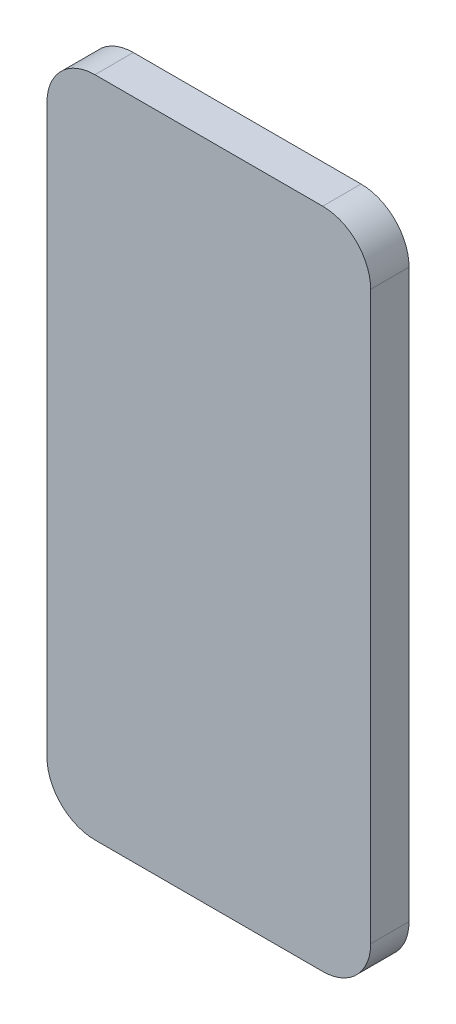
ISO-10303-21;
HEADER;
FILE_DESCRIPTION(('STEP AP214'),'2;1');
FILE_NAME('part.step','',(''),(''),'','','');
FILE_SCHEMA(('AUTOMOTIVE_DESIGN { 1 0 10303 214 1 1 1 1 }'));
ENDSEC;
DATA;
#1=APPLICATION_CONTEXT('core data for automotive mechanical design processes');
#2=APPLICATION_PROTOCOL_DEFINITION('international standard','automotive_design',2000,#1);
#3=PRODUCT_CONTEXT('',#1,'mechanical');
#4=PRODUCT('Part','Part','',(#3));
#5=PRODUCT_RELATED_PRODUCT_CATEGORY('part','',(#4));
#6=PRODUCT_DEFINITION_FORMATION('','',#4);
#7=PRODUCT_DEFINITION_CONTEXT('part definition',#1,'design');
#8=PRODUCT_DEFINITION('design','',#6,#7);
#9=PRODUCT_DEFINITION_SHAPE('','',#8);
#10=(LENGTH_UNIT() NAMED_UNIT(*) SI_UNIT(.MILLI.,.METRE.));
#11=(NAMED_UNIT(*) PLANE_ANGLE_UNIT() SI_UNIT($,.RADIAN.));
#12=(NAMED_UNIT(*) SI_UNIT($,.STERADIAN.) SOLID_ANGLE_UNIT());
#13=UNCERTAINTY_MEASURE_WITH_UNIT(LENGTH_MEASURE(1.E-05),#10,'distance_accuracy_value','');
#14=(GEOMETRIC_REPRESENTATION_CONTEXT(3) GLOBAL_UNCERTAINTY_ASSIGNED_CONTEXT((#13)) GLOBAL_UNIT_ASSIGNED_CONTEXT((#10,
#11,#12)) REPRESENTATION_CONTEXT('',''));
#15=CARTESIAN_POINT('',(0.,0.,0.));
#16=DIRECTION('',(0.,0.,1.));
#17=DIRECTION('',(1.,0.,0.));
#18=AXIS2_PLACEMENT_3D('',#15,#16,#17);
#19=CARTESIAN_POINT('',(22.606,56.261,7.62));
#20=DIRECTION('',(0.,0.,-1.));
#21=DIRECTION('',(-1.,0.,0.));
#22=AXIS2_PLACEMENT_3D('',#19,#20,#21);
#23=CYLINDRICAL_SURFACE('',#22,9.525);
#24=CARTESIAN_POINT('',(22.606,56.261,0.));
#25=DIRECTION('',(0.,0.,1.));
#26=DIRECTION('',(-1.,0.,0.));
#27=AXIS2_PLACEMENT_3D('',#24,#25,#26);
#28=CIRCLE('',#27,9.525);
#29=CARTESIAN_POINT('',(32.131,56.261,0.));
#30=VERTEX_POINT('',#29);
#31=CARTESIAN_POINT('',(22.606,65.786,0.));
#32=VERTEX_POINT('',#31);
#33=EDGE_CURVE('E140',#30,#32,#28,.T.);
#34=ORIENTED_EDGE('',*,*,#33,.T.);
#35=DIRECTION('',(0.,0.,-1.));
#36=VECTOR('',#35,1.);
#37=CARTESIAN_POINT('',(22.606,65.786,7.62));
#38=LINE('',#37,#36);
#39=CARTESIAN_POINT('',(22.606,65.786,7.62));
#40=VERTEX_POINT('',#39);
#41=EDGE_CURVE('E11',#40,#32,#38,.T.);
#42=ORIENTED_EDGE('',*,*,#41,.F.);
#43=CARTESIAN_POINT('',(22.606,56.261,7.62));
#44=DIRECTION('',(0.,0.,1.));
#45=DIRECTION('',(-1.,0.,0.));
#46=AXIS2_PLACEMENT_3D('',#43,#44,#45);
#47=CIRCLE('',#46,9.525);
#48=CARTESIAN_POINT('',(32.131,56.261,7.62));
#49=VERTEX_POINT('',#48);
#50=EDGE_CURVE('E162',#49,#40,#47,.T.);
#51=ORIENTED_EDGE('',*,*,#50,.F.);
#52=DIRECTION('',(0.,0.,-1.));
#53=VECTOR('',#52,1.);
#54=CARTESIAN_POINT('',(32.131,56.261,7.62));
#55=LINE('',#54,#53);
#56=EDGE_CURVE('E136',#49,#30,#55,.T.);
#57=ORIENTED_EDGE('',*,*,#56,.T.);
#58=EDGE_LOOP('',(#34,#42,#51,#57));
#59=FACE_BOUND('',#58,.T.);
#60=ADVANCED_FACE('F39',(#59),#23,.T.);
#61=CARTESIAN_POINT('',(-22.606,65.786,7.62));
#62=DIRECTION('',(0.,-1.,0.));
#63=DIRECTION('',(0.,0.,-1.));
#64=AXIS2_PLACEMENT_3D('',#61,#62,#63);
#65=PLANE('',#64);
#66=DIRECTION('',(-1.,0.,0.));
#67=VECTOR('',#66,1.);
#68=CARTESIAN_POINT('',(-22.606,65.786,0.));
#69=LINE('',#68,#67);
#70=CARTESIAN_POINT('',(-22.606,65.786,0.));
#71=VERTEX_POINT('',#70);
#72=EDGE_CURVE('E144',#32,#71,#69,.T.);
#73=ORIENTED_EDGE('',*,*,#72,.T.);
#74=DIRECTION('',(0.,0.,-1.));
#75=VECTOR('',#74,1.);
#76=CARTESIAN_POINT('',(-22.606,65.786,7.62));
#77=LINE('',#76,#75);
#78=CARTESIAN_POINT('',(-22.606,65.786,7.62));
#79=VERTEX_POINT('',#78);
#80=EDGE_CURVE('E48',#79,#71,#77,.T.);
#81=ORIENTED_EDGE('',*,*,#80,.F.);
#82=DIRECTION('',(-1.,0.,0.));
#83=VECTOR('',#82,1.);
#84=CARTESIAN_POINT('',(-22.606,65.786,7.62));
#85=LINE('',#84,#83);
#86=EDGE_CURVE('E99',#40,#79,#85,.T.);
#87=ORIENTED_EDGE('',*,*,#86,.F.);
#88=ORIENTED_EDGE('',*,*,#41,.T.);
#89=EDGE_LOOP('',(#73,#81,#87,#88));
#90=FACE_BOUND('',#89,.T.);
#91=ADVANCED_FACE('F208',(#90),#65,.F.);
#92=CARTESIAN_POINT('',(-22.606,56.261,7.62));
#93=DIRECTION('',(0.,0.,-1.));
#94=DIRECTION('',(-1.,0.,0.));
#95=AXIS2_PLACEMENT_3D('',#92,#93,#94);
#96=CYLINDRICAL_SURFACE('',#95,9.525);
#97=CARTESIAN_POINT('',(-22.606,56.261,0.));
#98=DIRECTION('',(0.,0.,1.));
#99=DIRECTION('',(-1.,0.,0.));
#100=AXIS2_PLACEMENT_3D('',#97,#98,#99);
#101=CIRCLE('',#100,9.525);
#102=CARTESIAN_POINT('',(-32.131,56.261,0.));
#103=VERTEX_POINT('',#102);
#104=EDGE_CURVE('E147',#71,#103,#101,.T.);
#105=ORIENTED_EDGE('',*,*,#104,.T.);
#106=DIRECTION('',(0.,0.,-1.));
#107=VECTOR('',#106,1.);
#108=CARTESIAN_POINT('',(-32.131,56.261,7.62));
#109=LINE('',#108,#107);
#110=CARTESIAN_POINT('',(-32.131,56.261,7.62));
#111=VERTEX_POINT('',#110);
#112=EDGE_CURVE('E173',#111,#103,#109,.T.);
#113=ORIENTED_EDGE('',*,*,#112,.F.);
#114=CARTESIAN_POINT('',(-22.606,56.261,7.62));
#115=DIRECTION('',(0.,0.,1.));
#116=DIRECTION('',(-1.,0.,0.));
#117=AXIS2_PLACEMENT_3D('',#114,#115,#116);
#118=CIRCLE('',#117,9.525);
#119=EDGE_CURVE('E183',#79,#111,#118,.T.);
#120=ORIENTED_EDGE('',*,*,#119,.F.);
#121=ORIENTED_EDGE('',*,*,#80,.T.);
#122=EDGE_LOOP('',(#105,#113,#120,#121));
#123=FACE_BOUND('',#122,.T.);
#124=ADVANCED_FACE('F181',(#123),#96,.T.);
#125=CARTESIAN_POINT('',(-32.131,-56.261,7.62));
#126=DIRECTION('',(1.,0.,0.));
#127=DIRECTION('',(0.,0.,-1.));
#128=AXIS2_PLACEMENT_3D('',#125,#126,#127);
#129=PLANE('',#128);
#130=DIRECTION('',(0.,-1.,0.));
#131=VECTOR('',#130,1.);
#132=CARTESIAN_POINT('',(-32.131,-56.261,0.));
#133=LINE('',#132,#131);
#134=CARTESIAN_POINT('',(-32.131,-56.261,0.));
#135=VERTEX_POINT('',#134);
#136=EDGE_CURVE('E150',#103,#135,#133,.T.);
#137=ORIENTED_EDGE('',*,*,#136,.T.);
#138=DIRECTION('',(0.,0.,-1.));
#139=VECTOR('',#138,1.);
#140=CARTESIAN_POINT('',(-32.131,-56.261,7.62));
#141=LINE('',#140,#139);
#142=CARTESIAN_POINT('',(-32.131,-56.261,7.62));
#143=VERTEX_POINT('',#142);
#144=EDGE_CURVE('E169',#143,#135,#141,.T.);
#145=ORIENTED_EDGE('',*,*,#144,.F.);
#146=DIRECTION('',(0.,-1.,0.));
#147=VECTOR('',#146,1.);
#148=CARTESIAN_POINT('',(-32.131,-56.261,7.62));
#149=LINE('',#148,#147);
#150=EDGE_CURVE('E196',#111,#143,#149,.T.);
#151=ORIENTED_EDGE('',*,*,#150,.F.);
#152=ORIENTED_EDGE('',*,*,#112,.T.);
#153=EDGE_LOOP('',(#137,#145,#151,#152));
#154=FACE_BOUND('',#153,.T.);
#155=ADVANCED_FACE('F191',(#154),#129,.F.);
#156=CARTESIAN_POINT('',(-22.606,-56.261,7.62));
#157=DIRECTION('',(0.,0.,-1.));
#158=DIRECTION('',(-1.,0.,0.));
#159=AXIS2_PLACEMENT_3D('',#156,#157,#158);
#160=CYLINDRICAL_SURFACE('',#159,9.525);
#161=CARTESIAN_POINT('',(-22.606,-56.261,0.));
#162=DIRECTION('',(0.,0.,1.));
#163=DIRECTION('',(-1.,0.,0.));
#164=AXIS2_PLACEMENT_3D('',#161,#162,#163);
#165=CIRCLE('',#164,9.525);
#166=CARTESIAN_POINT('',(-22.606,-65.786,0.));
#167=VERTEX_POINT('',#166);
#168=EDGE_CURVE('E153',#135,#167,#165,.T.);
#169=ORIENTED_EDGE('',*,*,#168,.T.);
#170=DIRECTION('',(0.,0.,-1.));
#171=VECTOR('',#170,1.);
#172=CARTESIAN_POINT('',(-22.606,-65.786,7.62));
#173=LINE('',#172,#171);
#174=CARTESIAN_POINT('',(-22.606,-65.786,7.62));
#175=VERTEX_POINT('',#174);
#176=EDGE_CURVE('E129',#175,#167,#173,.T.);
#177=ORIENTED_EDGE('',*,*,#176,.F.);
#178=CARTESIAN_POINT('',(-22.606,-56.261,7.62));
#179=DIRECTION('',(0.,0.,1.));
#180=DIRECTION('',(-1.,0.,0.));
#181=AXIS2_PLACEMENT_3D('',#178,#179,#180);
#182=CIRCLE('',#181,9.525);
#183=EDGE_CURVE('E118',#143,#175,#182,.T.);
#184=ORIENTED_EDGE('',*,*,#183,.F.);
#185=ORIENTED_EDGE('',*,*,#144,.T.);
#186=EDGE_LOOP('',(#169,#177,#184,#185));
#187=FACE_BOUND('',#186,.T.);
#188=ADVANCED_FACE('F194',(#187),#160,.T.);
#189=CARTESIAN_POINT('',(-22.606,-65.786,7.62));
#190=DIRECTION('',(0.,1.,0.));
#191=DIRECTION('',(0.,0.,1.));
#192=AXIS2_PLACEMENT_3D('',#189,#190,#191);
#193=PLANE('',#192);
#194=DIRECTION('',(1.,0.,0.));
#195=VECTOR('',#194,1.);
#196=CARTESIAN_POINT('',(-22.606,-65.786,0.));
#197=LINE('',#196,#195);
#198=CARTESIAN_POINT('',(22.606,-65.786,0.));
#199=VERTEX_POINT('',#198);
#200=EDGE_CURVE('E127',#167,#199,#197,.T.);
#201=ORIENTED_EDGE('',*,*,#200,.T.);
#202=DIRECTION('',(0.,0.,-1.));
#203=VECTOR('',#202,1.);
#204=CARTESIAN_POINT('',(22.606,-65.786,7.62));
#205=LINE('',#204,#203);
#206=CARTESIAN_POINT('',(22.606,-65.786,7.62));
#207=VERTEX_POINT('',#206);
#208=EDGE_CURVE('E124',#207,#199,#205,.T.);
#209=ORIENTED_EDGE('',*,*,#208,.F.);
#210=DIRECTION('',(1.,0.,0.));
#211=VECTOR('',#210,1.);
#212=CARTESIAN_POINT('',(-22.606,-65.786,7.62));
#213=LINE('',#212,#211);
#214=EDGE_CURVE('E112',#175,#207,#213,.T.);
#215=ORIENTED_EDGE('',*,*,#214,.F.);
#216=ORIENTED_EDGE('',*,*,#176,.T.);
#217=EDGE_LOOP('',(#201,#209,#215,#216));
#218=FACE_BOUND('',#217,.T.);
#219=ADVANCED_FACE('F125',(#218),#193,.F.);
#220=CARTESIAN_POINT('',(22.606,-56.261,7.62));
#221=DIRECTION('',(0.,0.,-1.));
#222=DIRECTION('',(-1.,0.,0.));
#223=AXIS2_PLACEMENT_3D('',#220,#221,#222);
#224=CYLINDRICAL_SURFACE('',#223,9.525);
#225=CARTESIAN_POINT('',(22.606,-56.261,0.));
#226=DIRECTION('',(0.,0.,1.));
#227=DIRECTION('',(1.,0.,0.));
#228=AXIS2_PLACEMENT_3D('',#225,#226,#227);
#229=CIRCLE('',#228,9.525);
#230=CARTESIAN_POINT('',(32.131,-56.261,0.));
#231=VERTEX_POINT('',#230);
#232=EDGE_CURVE('E85',#199,#231,#229,.T.);
#233=ORIENTED_EDGE('',*,*,#232,.T.);
#234=DIRECTION('',(0.,0.,-1.));
#235=VECTOR('',#234,1.);
#236=CARTESIAN_POINT('',(32.131,-56.261,7.62));
#237=LINE('',#236,#235);
#238=CARTESIAN_POINT('',(32.131,-56.261,7.62));
#239=VERTEX_POINT('',#238);
#240=EDGE_CURVE('E130',#239,#231,#237,.T.);
#241=ORIENTED_EDGE('',*,*,#240,.F.);
#242=CARTESIAN_POINT('',(22.606,-56.261,7.62));
#243=DIRECTION('',(0.,0.,1.));
#244=DIRECTION('',(1.,0.,0.));
#245=AXIS2_PLACEMENT_3D('',#242,#243,#244);
#246=CIRCLE('',#245,9.525);
#247=EDGE_CURVE('E116',#207,#239,#246,.T.);
#248=ORIENTED_EDGE('',*,*,#247,.F.);
#249=ORIENTED_EDGE('',*,*,#208,.T.);
#250=EDGE_LOOP('',(#233,#241,#248,#249));
#251=FACE_BOUND('',#250,.T.);
#252=ADVANCED_FACE('F132',(#251),#224,.T.);
#253=CARTESIAN_POINT('',(32.131,-56.261,7.62));
#254=DIRECTION('',(-1.,0.,0.));
#255=DIRECTION('',(0.,0.,1.));
#256=AXIS2_PLACEMENT_3D('',#253,#254,#255);
#257=PLANE('',#256);
#258=DIRECTION('',(0.,1.,0.));
#259=VECTOR('',#258,1.);
#260=CARTESIAN_POINT('',(32.131,-56.261,0.));
#261=LINE('',#260,#259);
#262=EDGE_CURVE('E91',#231,#30,#261,.T.);
#263=ORIENTED_EDGE('',*,*,#262,.T.);
#264=ORIENTED_EDGE('',*,*,#56,.F.);
#265=DIRECTION('',(0.,1.,0.));
#266=VECTOR('',#265,1.);
#267=CARTESIAN_POINT('',(32.131,-56.261,7.62));
#268=LINE('',#267,#266);
#269=EDGE_CURVE('E56',#239,#49,#268,.T.);
#270=ORIENTED_EDGE('',*,*,#269,.F.);
#271=ORIENTED_EDGE('',*,*,#240,.T.);
#272=EDGE_LOOP('',(#263,#264,#270,#271));
#273=FACE_BOUND('',#272,.T.);
#274=ADVANCED_FACE('F224',(#273),#257,.F.);
#275=CARTESIAN_POINT('',(22.606,56.261,7.62));
#276=DIRECTION('',(0.,0.,-1.));
#277=DIRECTION('',(-1.,0.,0.));
#278=AXIS2_PLACEMENT_3D('',#275,#276,#277);
#279=PLANE('',#278);
#280=ORIENTED_EDGE('',*,*,#50,.T.);
#281=ORIENTED_EDGE('',*,*,#86,.T.);
#282=ORIENTED_EDGE('',*,*,#119,.T.);
#283=ORIENTED_EDGE('',*,*,#150,.T.);
#284=ORIENTED_EDGE('',*,*,#183,.T.);
#285=ORIENTED_EDGE('',*,*,#214,.T.);
#286=ORIENTED_EDGE('',*,*,#247,.T.);
#287=ORIENTED_EDGE('',*,*,#269,.T.);
#288=EDGE_LOOP('',(#280,#281,#282,#283,#284,#285,#286,#287));
#289=FACE_BOUND('',#288,.T.);
#290=ADVANCED_FACE('F114',(#289),#279,.F.);
#291=CARTESIAN_POINT('',(22.606,56.261,0.));
#292=DIRECTION('',(0.,0.,-1.));
#293=DIRECTION('',(-1.,0.,0.));
#294=AXIS2_PLACEMENT_3D('',#291,#292,#293);
#295=PLANE('',#294);
#296=ORIENTED_EDGE('',*,*,#33,.F.);
#297=ORIENTED_EDGE('',*,*,#262,.F.);
#298=ORIENTED_EDGE('',*,*,#232,.F.);
#299=ORIENTED_EDGE('',*,*,#200,.F.);
#300=ORIENTED_EDGE('',*,*,#168,.F.);
#301=ORIENTED_EDGE('',*,*,#136,.F.);
#302=ORIENTED_EDGE('',*,*,#104,.F.);
#303=ORIENTED_EDGE('',*,*,#72,.F.);
#304=EDGE_LOOP('',(#296,#297,#298,#299,#300,#301,#302,#303));
#305=FACE_BOUND('',#304,.T.);
#306=ADVANCED_FACE('F187',(#305),#295,.T.);
#307=CLOSED_SHELL('',(#60,#91,#124,#155,#188,#219,#252,#274,#290,#306));
#308=MANIFOLD_SOLID_BREP('B2',#307);
#309=ADVANCED_BREP_SHAPE_REPRESENTATION('',(#18,#308),#14);
#310=SHAPE_DEFINITION_REPRESENTATION(#9,#309);
ENDSEC;
END-ISO-10303-21;
